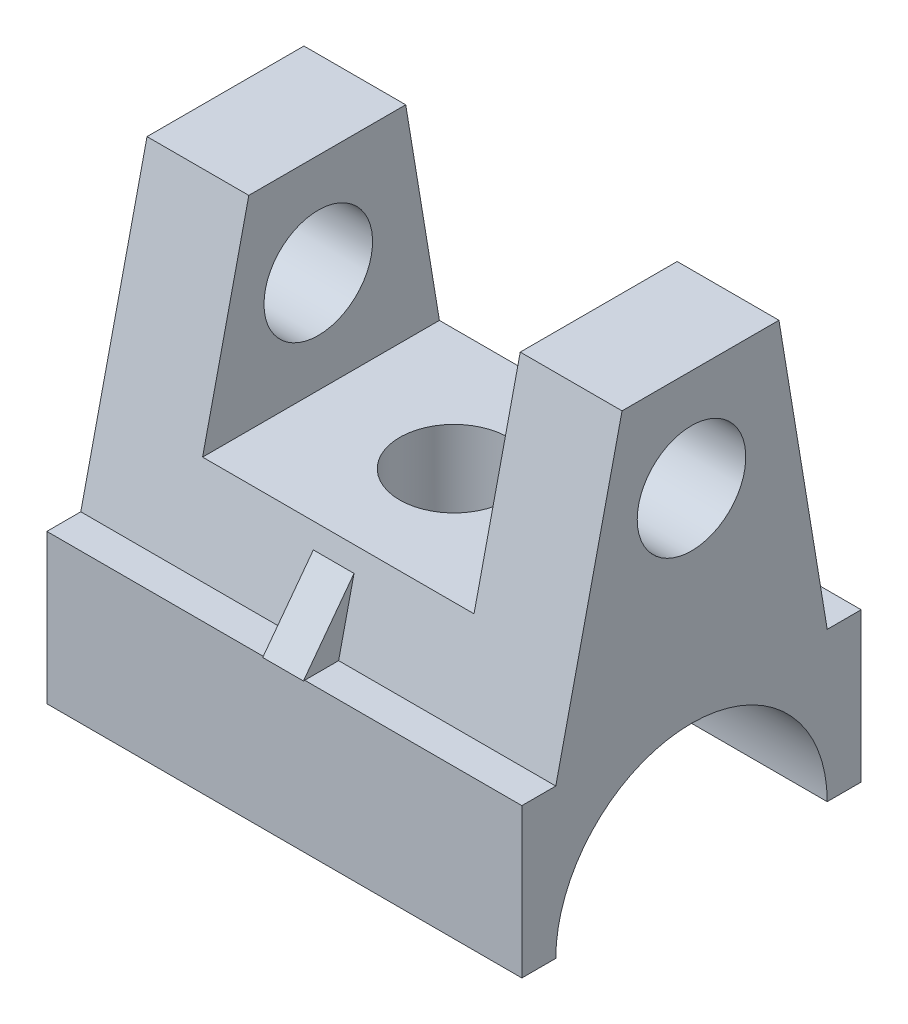
ISO-10303-21;
HEADER;
FILE_DESCRIPTION(('STEP AP214'),'2;1');
FILE_NAME('part.step','',(''),(''),'','','');
FILE_SCHEMA(('AUTOMOTIVE_DESIGN { 1 0 10303 214 1 1 1 1 }'));
ENDSEC;
DATA;
#1=APPLICATION_CONTEXT('core data for automotive mechanical design processes');
#2=APPLICATION_PROTOCOL_DEFINITION('international standard','automotive_design',2000,#1);
#3=PRODUCT_CONTEXT('',#1,'mechanical');
#4=PRODUCT('Part','Part','',(#3));
#5=PRODUCT_RELATED_PRODUCT_CATEGORY('part','',(#4));
#6=PRODUCT_DEFINITION_FORMATION('','',#4);
#7=PRODUCT_DEFINITION_CONTEXT('part definition',#1,'design');
#8=PRODUCT_DEFINITION('design','',#6,#7);
#9=PRODUCT_DEFINITION_SHAPE('','',#8);
#10=(LENGTH_UNIT() NAMED_UNIT(*) SI_UNIT(.MILLI.,.METRE.));
#11=(NAMED_UNIT(*) PLANE_ANGLE_UNIT() SI_UNIT($,.RADIAN.));
#12=(NAMED_UNIT(*) SI_UNIT($,.STERADIAN.) SOLID_ANGLE_UNIT());
#13=UNCERTAINTY_MEASURE_WITH_UNIT(LENGTH_MEASURE(1.E-05),#10,'distance_accuracy_value','');
#14=(GEOMETRIC_REPRESENTATION_CONTEXT(3) GLOBAL_UNCERTAINTY_ASSIGNED_CONTEXT((#13)) GLOBAL_UNIT_ASSIGNED_CONTEXT((#10,
#11,#12)) REPRESENTATION_CONTEXT('',''));
#15=CARTESIAN_POINT('',(0.,0.,0.));
#16=DIRECTION('',(0.,0.,1.));
#17=DIRECTION('',(1.,0.,0.));
#18=AXIS2_PLACEMENT_3D('',#15,#16,#17);
#19=CARTESIAN_POINT('',(0.,44.,0.));
#20=DIRECTION('',(0.,-1.,0.));
#21=DIRECTION('',(0.,0.,-1.));
#22=AXIS2_PLACEMENT_3D('',#19,#20,#21);
#23=PLANE('',#22);
#24=DIRECTION('',(0.,0.,-1.));
#25=VECTOR('',#24,1.);
#26=CARTESIAN_POINT('',(64.,44.,-90.));
#27=LINE('',#26,#25);
#28=CARTESIAN_POINT('',(64.,44.,-90.));
#29=VERTEX_POINT('',#28);
#30=CARTESIAN_POINT('',(64.,44.,-100.));
#31=VERTEX_POINT('',#30);
#32=EDGE_CURVE('E60',#29,#31,#27,.T.);
#33=ORIENTED_EDGE('',*,*,#32,.T.);
#34=DIRECTION('',(1.,0.,0.));
#35=VECTOR('',#34,1.);
#36=CARTESIAN_POINT('',(0.,44.,-100.));
#37=LINE('',#36,#35);
#38=CARTESIAN_POINT('',(0.,44.,-100.));
#39=VERTEX_POINT('',#38);
#40=EDGE_CURVE('E431',#39,#31,#37,.T.);
#41=ORIENTED_EDGE('',*,*,#40,.F.);
#42=DIRECTION('',(0.,0.,1.));
#43=VECTOR('',#42,1.);
#44=CARTESIAN_POINT('',(0.,44.,-100.));
#45=LINE('',#44,#43);
#46=CARTESIAN_POINT('',(0.,44.,-90.));
#47=VERTEX_POINT('',#46);
#48=EDGE_CURVE('E383',#39,#47,#45,.T.);
#49=ORIENTED_EDGE('',*,*,#48,.T.);
#50=DIRECTION('',(-1.,0.,0.));
#51=VECTOR('',#50,1.);
#52=CARTESIAN_POINT('',(140.,44.,-90.));
#53=LINE('',#52,#51);
#54=EDGE_CURVE('E478',#29,#47,#53,.T.);
#55=ORIENTED_EDGE('',*,*,#54,.F.);
#56=EDGE_LOOP('',(#33,#41,#49,#55));
#57=FACE_BOUND('',#56,.T.);
#58=ADVANCED_FACE('F36',(#57),#23,.F.);
#59=CARTESIAN_POINT('',(140.,44.,-90.));
#60=DIRECTION('',(0.,0.163185462498072,-0.986595410910313));
#61=DIRECTION('',(0.,0.986595410910314,0.163185462498072));
#62=AXIS2_PLACEMENT_3D('',#59,#60,#61);
#63=PLANE('',#62);
#64=DIRECTION('',(1.,0.,0.));
#65=VECTOR('',#64,1.);
#66=CARTESIAN_POINT('',(64.,64.,-86.6919476678388));
#67=LINE('',#66,#65);
#68=CARTESIAN_POINT('',(64.,64.0000000000001,-86.6919476678387));
#69=VERTEX_POINT('',#68);
#70=CARTESIAN_POINT('',(76.,64.,-86.6919476678387));
#71=VERTEX_POINT('',#70);
#72=EDGE_CURVE('E211',#69,#71,#67,.T.);
#73=ORIENTED_EDGE('',*,*,#72,.F.);
#74=DIRECTION('',(0.,-0.986595410910314,-0.16318546249807));
#75=VECTOR('',#74,1.);
#76=CARTESIAN_POINT('',(64.,64.,-86.6919476678388));
#77=LINE('',#76,#75);
#78=EDGE_CURVE('E199',#69,#29,#77,.T.);
#79=ORIENTED_EDGE('',*,*,#78,.T.);
#80=ORIENTED_EDGE('',*,*,#54,.T.);
#81=DIRECTION('',(0.,-0.986595410910313,-0.163185462498072));
#82=VECTOR('',#81,1.);
#83=CARTESIAN_POINT('',(0.,44.,-90.));
#84=LINE('',#83,#82);
#85=CARTESIAN_POINT('',(0.,130.,-75.7753749717067));
#86=VERTEX_POINT('',#85);
#87=EDGE_CURVE('E476',#86,#47,#84,.T.);
#88=ORIENTED_EDGE('',*,*,#87,.F.);
#89=DIRECTION('',(-1.,0.,0.));
#90=VECTOR('',#89,1.);
#91=CARTESIAN_POINT('',(140.,130.,-75.7753749717067));
#92=LINE('',#91,#90);
#93=CARTESIAN_POINT('',(30.,130.,-75.7753749717067));
#94=VERTEX_POINT('',#93);
#95=EDGE_CURVE('E412',#94,#86,#92,.T.);
#96=ORIENTED_EDGE('',*,*,#95,.F.);
#97=DIRECTION('',(0.,0.986595410910314,0.163185462498072));
#98=VECTOR('',#97,1.);
#99=CARTESIAN_POINT('',(30.,44.,-90.));
#100=LINE('',#99,#98);
#101=CARTESIAN_POINT('',(30.,70.,-85.6995319681904));
#102=VERTEX_POINT('',#101);
#103=EDGE_CURVE('E473',#102,#94,#100,.T.);
#104=ORIENTED_EDGE('',*,*,#103,.F.);
#105=DIRECTION('',(-1.,0.,0.));
#106=VECTOR('',#105,1.);
#107=CARTESIAN_POINT('',(140.,70.,-85.6995319681904));
#108=LINE('',#107,#106);
#109=CARTESIAN_POINT('',(110.,70.,-85.6995319681904));
#110=VERTEX_POINT('',#109);
#111=EDGE_CURVE('E486',#110,#102,#108,.T.);
#112=ORIENTED_EDGE('',*,*,#111,.F.);
#113=DIRECTION('',(0.,-0.986595410910314,-0.163185462498072));
#114=VECTOR('',#113,1.);
#115=CARTESIAN_POINT('',(110.,44.,-90.));
#116=LINE('',#115,#114);
#117=CARTESIAN_POINT('',(110.,130.,-75.7753749717067));
#118=VERTEX_POINT('',#117);
#119=EDGE_CURVE('E489',#118,#110,#116,.T.);
#120=ORIENTED_EDGE('',*,*,#119,.F.);
#121=CARTESIAN_POINT('',(140.,130.,-75.7753749717067));
#122=VERTEX_POINT('',#121);
#123=EDGE_CURVE('E408',#122,#118,#92,.T.);
#124=ORIENTED_EDGE('',*,*,#123,.F.);
#125=DIRECTION('',(0.,-0.986595410910313,-0.163185462498072));
#126=VECTOR('',#125,1.);
#127=CARTESIAN_POINT('',(140.,44.,-90.));
#128=LINE('',#127,#126);
#129=CARTESIAN_POINT('',(140.,44.,-90.));
#130=VERTEX_POINT('',#129);
#131=EDGE_CURVE('E463',#122,#130,#128,.T.);
#132=ORIENTED_EDGE('',*,*,#131,.T.);
#133=CARTESIAN_POINT('',(76.,44.,-90.));
#134=VERTEX_POINT('',#133);
#135=EDGE_CURVE('E422',#130,#134,#53,.T.);
#136=ORIENTED_EDGE('',*,*,#135,.T.);
#137=DIRECTION('',(0.,-0.986595410910314,-0.16318546249807));
#138=VECTOR('',#137,1.);
#139=CARTESIAN_POINT('',(76.,64.,-86.6919476678388));
#140=LINE('',#139,#138);
#141=EDGE_CURVE('E503',#71,#134,#140,.T.);
#142=ORIENTED_EDGE('',*,*,#141,.F.);
#143=EDGE_LOOP('',(#73,#79,#80,#88,#96,#104,#112,#120,#124,#132,#136,#142));
#144=FACE_BOUND('',#143,.T.);
#145=ADVANCED_FACE('F291',(#144),#63,.T.);
#146=DIRECTION('',(0.,0.,-1.));
#147=VECTOR('',#146,1.);
#148=CARTESIAN_POINT('',(64.,44.,0.380318398329267));
#149=LINE('',#148,#147);
#150=CARTESIAN_POINT('',(64.,44.,0.));
#151=VERTEX_POINT('',#150);
#152=CARTESIAN_POINT('',(64.,44.,-10.));
#153=VERTEX_POINT('',#152);
#154=EDGE_CURVE('E221',#151,#153,#149,.T.);
#155=ORIENTED_EDGE('',*,*,#154,.T.);
#156=DIRECTION('',(-1.,0.,0.));
#157=VECTOR('',#156,1.);
#158=CARTESIAN_POINT('',(140.,44.,-10.));
#159=LINE('',#158,#157);
#160=CARTESIAN_POINT('',(0.,44.,-10.));
#161=VERTEX_POINT('',#160);
#162=EDGE_CURVE('E420',#153,#161,#159,.T.);
#163=ORIENTED_EDGE('',*,*,#162,.T.);
#164=CARTESIAN_POINT('',(0.,44.,0.));
#165=VERTEX_POINT('',#164);
#166=EDGE_CURVE('E432',#161,#165,#45,.T.);
#167=ORIENTED_EDGE('',*,*,#166,.T.);
#168=DIRECTION('',(1.,0.,0.));
#169=VECTOR('',#168,1.);
#170=CARTESIAN_POINT('',(0.,44.,0.));
#171=LINE('',#170,#169);
#172=EDGE_CURVE('E424',#165,#151,#171,.T.);
#173=ORIENTED_EDGE('',*,*,#172,.T.);
#174=EDGE_LOOP('',(#155,#163,#167,#173));
#175=FACE_BOUND('',#174,.T.);
#176=ADVANCED_FACE('F294',(#175),#23,.F.);
#177=CARTESIAN_POINT('',(140.,130.,-29.5244844802235));
#178=DIRECTION('',(0.,0.221394989815989,0.975184217717031));
#179=DIRECTION('',(0.,-0.975184217717031,0.221394989815989));
#180=AXIS2_PLACEMENT_3D('',#177,#178,#179);
#181=PLANE('',#180);
#182=ORIENTED_EDGE('',*,*,#162,.F.);
#183=DIRECTION('',(0.,-0.975184217717031,0.22139498981599));
#184=VECTOR('',#183,1.);
#185=CARTESIAN_POINT('',(64.,64.,-14.5405777860985));
#186=LINE('',#185,#184);
#187=CARTESIAN_POINT('',(64.,64.,-14.5405777860985));
#188=VERTEX_POINT('',#187);
#189=EDGE_CURVE('E226',#188,#153,#186,.T.);
#190=ORIENTED_EDGE('',*,*,#189,.F.);
#191=DIRECTION('',(1.,0.,0.));
#192=VECTOR('',#191,1.);
#193=CARTESIAN_POINT('',(64.,64.,-14.5405777860985));
#194=LINE('',#193,#192);
#195=CARTESIAN_POINT('',(76.,64.,-14.5405777860985));
#196=VERTEX_POINT('',#195);
#197=EDGE_CURVE('E237',#188,#196,#194,.T.);
#198=ORIENTED_EDGE('',*,*,#197,.T.);
#199=DIRECTION('',(0.,-0.975184217717031,0.22139498981599));
#200=VECTOR('',#199,1.);
#201=CARTESIAN_POINT('',(76.,64.,-14.5405777860985));
#202=LINE('',#201,#200);
#203=CARTESIAN_POINT('',(76.,44.,-10.));
#204=VERTEX_POINT('',#203);
#205=EDGE_CURVE('E222',#196,#204,#202,.T.);
#206=ORIENTED_EDGE('',*,*,#205,.T.);
#207=CARTESIAN_POINT('',(140.,44.,-10.));
#208=VERTEX_POINT('',#207);
#209=EDGE_CURVE('E416',#208,#204,#159,.T.);
#210=ORIENTED_EDGE('',*,*,#209,.F.);
#211=DIRECTION('',(0.,0.975184217717031,-0.221394989815989));
#212=VECTOR('',#211,1.);
#213=CARTESIAN_POINT('',(140.,130.,-29.5244844802235));
#214=LINE('',#213,#212);
#215=CARTESIAN_POINT('',(140.,130.,-29.5244844802235));
#216=VERTEX_POINT('',#215);
#217=EDGE_CURVE('E411',#208,#216,#214,.T.);
#218=ORIENTED_EDGE('',*,*,#217,.T.);
#219=DIRECTION('',(-1.,0.,0.));
#220=VECTOR('',#219,1.);
#221=CARTESIAN_POINT('',(140.,130.,-29.5244844802235));
#222=LINE('',#221,#220);
#223=CARTESIAN_POINT('',(110.,130.,-29.5244844802235));
#224=VERTEX_POINT('',#223);
#225=EDGE_CURVE('E406',#216,#224,#222,.T.);
#226=ORIENTED_EDGE('',*,*,#225,.T.);
#227=DIRECTION('',(0.,0.975184217717031,-0.221394989815989));
#228=VECTOR('',#227,1.);
#229=CARTESIAN_POINT('',(110.,130.,-29.5244844802235));
#230=LINE('',#229,#228);
#231=CARTESIAN_POINT('',(110.,70.,-15.902751121928));
#232=VERTEX_POINT('',#231);
#233=EDGE_CURVE('E45',#232,#224,#230,.T.);
#234=ORIENTED_EDGE('',*,*,#233,.F.);
#235=DIRECTION('',(1.,0.,0.));
#236=VECTOR('',#235,1.);
#237=CARTESIAN_POINT('',(140.,70.,-15.9027511219281));
#238=LINE('',#237,#236);
#239=CARTESIAN_POINT('',(30.,70.,-15.902751121928));
#240=VERTEX_POINT('',#239);
#241=EDGE_CURVE('E392',#240,#232,#238,.T.);
#242=ORIENTED_EDGE('',*,*,#241,.F.);
#243=DIRECTION('',(0.,-0.975184217717031,0.221394989815989));
#244=VECTOR('',#243,1.);
#245=CARTESIAN_POINT('',(30.,130.,-29.5244844802235));
#246=LINE('',#245,#244);
#247=CARTESIAN_POINT('',(30.,130.,-29.5244844802235));
#248=VERTEX_POINT('',#247);
#249=EDGE_CURVE('E11',#248,#240,#246,.T.);
#250=ORIENTED_EDGE('',*,*,#249,.F.);
#251=CARTESIAN_POINT('',(0.,130.,-29.5244844802235));
#252=VERTEX_POINT('',#251);
#253=EDGE_CURVE('E413',#248,#252,#222,.T.);
#254=ORIENTED_EDGE('',*,*,#253,.T.);
#255=DIRECTION('',(0.,0.975184217717031,-0.221394989815989));
#256=VECTOR('',#255,1.);
#257=CARTESIAN_POINT('',(0.,130.,-29.5244844802235));
#258=LINE('',#257,#256);
#259=EDGE_CURVE('E462',#161,#252,#258,.T.);
#260=ORIENTED_EDGE('',*,*,#259,.F.);
#261=EDGE_LOOP('',(#182,#190,#198,#206,#210,#218,#226,#234,#242,#250,#254,#260));
#262=FACE_BOUND('',#261,.T.);
#263=ADVANCED_FACE('F299',(#262),#181,.T.);
#264=CARTESIAN_POINT('',(140.,130.,-75.7753749717067));
#265=DIRECTION('',(0.,1.,0.));
#266=DIRECTION('',(0.,0.,1.));
#267=AXIS2_PLACEMENT_3D('',#264,#265,#266);
#268=PLANE('',#267);
#269=DIRECTION('',(0.,0.,1.));
#270=VECTOR('',#269,1.);
#271=CARTESIAN_POINT('',(30.,130.,-100.));
#272=LINE('',#271,#270);
#273=EDGE_CURVE('E263',#94,#248,#272,.T.);
#274=ORIENTED_EDGE('',*,*,#273,.F.);
#275=ORIENTED_EDGE('',*,*,#95,.T.);
#276=DIRECTION('',(0.,0.,-1.));
#277=VECTOR('',#276,1.);
#278=CARTESIAN_POINT('',(0.,130.,-75.7753749717067));
#279=LINE('',#278,#277);
#280=EDGE_CURVE('E472',#252,#86,#279,.T.);
#281=ORIENTED_EDGE('',*,*,#280,.F.);
#282=ORIENTED_EDGE('',*,*,#253,.F.);
#283=EDGE_LOOP('',(#274,#275,#281,#282));
#284=FACE_BOUND('',#283,.T.);
#285=ADVANCED_FACE('F298',(#284),#268,.T.);
#286=CARTESIAN_POINT('',(76.,44.,-100.));
#287=VERTEX_POINT('',#286);
#288=CARTESIAN_POINT('',(140.,44.,-100.));
#289=VERTEX_POINT('',#288);
#290=EDGE_CURVE('E52',#287,#289,#37,.T.);
#291=ORIENTED_EDGE('',*,*,#290,.F.);
#292=DIRECTION('',(0.,0.,-1.));
#293=VECTOR('',#292,1.);
#294=CARTESIAN_POINT('',(76.,44.,-90.));
#295=LINE('',#294,#293);
#296=EDGE_CURVE('E498',#134,#287,#295,.T.);
#297=ORIENTED_EDGE('',*,*,#296,.F.);
#298=ORIENTED_EDGE('',*,*,#135,.F.);
#299=DIRECTION('',(0.,0.,1.));
#300=VECTOR('',#299,1.);
#301=CARTESIAN_POINT('',(140.,44.,-100.));
#302=LINE('',#301,#300);
#303=EDGE_CURVE('E428',#289,#130,#302,.T.);
#304=ORIENTED_EDGE('',*,*,#303,.F.);
#305=EDGE_LOOP('',(#291,#297,#298,#304));
#306=FACE_BOUND('',#305,.T.);
#307=ADVANCED_FACE('F306',(#306),#23,.F.);
#308=CARTESIAN_POINT('',(0.,0.,0.));
#309=DIRECTION('',(0.,-1.,0.));
#310=DIRECTION('',(0.,0.,-1.));
#311=AXIS2_PLACEMENT_3D('',#308,#309,#310);
#312=PLANE('',#311);
#313=DIRECTION('',(0.,0.,1.));
#314=VECTOR('',#313,1.);
#315=CARTESIAN_POINT('',(0.,0.,-100.));
#316=LINE('',#315,#314);
#317=CARTESIAN_POINT('',(0.,0.,-10.));
#318=VERTEX_POINT('',#317);
#319=CARTESIAN_POINT('',(0.,0.,0.));
#320=VERTEX_POINT('',#319);
#321=EDGE_CURVE('E371',#318,#320,#316,.T.);
#322=ORIENTED_EDGE('',*,*,#321,.F.);
#323=DIRECTION('',(1.,0.,0.));
#324=VECTOR('',#323,1.);
#325=CARTESIAN_POINT('',(-396.979728804231,0.,-9.99999999999996));
#326=LINE('',#325,#324);
#327=CARTESIAN_POINT('',(140.,0.,-10.));
#328=VERTEX_POINT('',#327);
#329=EDGE_CURVE('E362',#318,#328,#326,.T.);
#330=ORIENTED_EDGE('',*,*,#329,.T.);
#331=DIRECTION('',(0.,0.,1.));
#332=VECTOR('',#331,1.);
#333=CARTESIAN_POINT('',(140.,0.,-100.));
#334=LINE('',#333,#332);
#335=CARTESIAN_POINT('',(140.,0.,0.));
#336=VERTEX_POINT('',#335);
#337=EDGE_CURVE('E358',#328,#336,#334,.T.);
#338=ORIENTED_EDGE('',*,*,#337,.T.);
#339=DIRECTION('',(1.,0.,0.));
#340=VECTOR('',#339,1.);
#341=CARTESIAN_POINT('',(0.,0.,0.));
#342=LINE('',#341,#340);
#343=EDGE_CURVE('E361',#320,#336,#342,.T.);
#344=ORIENTED_EDGE('',*,*,#343,.F.);
#345=EDGE_LOOP('',(#322,#330,#338,#344));
#346=FACE_BOUND('',#345,.T.);
#347=ADVANCED_FACE('F324',(#346),#312,.T.);
#348=CARTESIAN_POINT('',(0.,44.,0.));
#349=DIRECTION('',(0.,0.,-1.));
#350=DIRECTION('',(-1.,0.,0.));
#351=AXIS2_PLACEMENT_3D('',#348,#349,#350);
#352=PLANE('',#351);
#353=ORIENTED_EDGE('',*,*,#343,.T.);
#354=DIRECTION('',(0.,-1.,0.));
#355=VECTOR('',#354,1.);
#356=CARTESIAN_POINT('',(140.,44.,0.));
#357=LINE('',#356,#355);
#358=CARTESIAN_POINT('',(140.,44.,0.));
#359=VERTEX_POINT('',#358);
#360=EDGE_CURVE('E387',#359,#336,#357,.T.);
#361=ORIENTED_EDGE('',*,*,#360,.F.);
#362=CARTESIAN_POINT('',(76.,44.,0.));
#363=VERTEX_POINT('',#362);
#364=EDGE_CURVE('E378',#363,#359,#171,.T.);
#365=ORIENTED_EDGE('',*,*,#364,.F.);
#366=DIRECTION('',(-1.,0.,0.));
#367=VECTOR('',#366,1.);
#368=CARTESIAN_POINT('',(0.,44.,0.));
#369=LINE('',#368,#367);
#370=EDGE_CURVE('E239',#363,#151,#369,.T.);
#371=ORIENTED_EDGE('',*,*,#370,.T.);
#372=ORIENTED_EDGE('',*,*,#172,.F.);
#373=DIRECTION('',(0.,-1.,0.));
#374=VECTOR('',#373,1.);
#375=CARTESIAN_POINT('',(0.,44.,0.));
#376=LINE('',#375,#374);
#377=EDGE_CURVE('E379',#165,#320,#376,.T.);
#378=ORIENTED_EDGE('',*,*,#377,.T.);
#379=EDGE_LOOP('',(#353,#361,#365,#371,#372,#378));
#380=FACE_BOUND('',#379,.T.);
#381=ADVANCED_FACE('F38',(#380),#352,.F.);
#382=CARTESIAN_POINT('',(140.,44.,-100.));
#383=DIRECTION('',(1.,0.,0.));
#384=DIRECTION('',(0.,0.,-1.));
#385=AXIS2_PLACEMENT_3D('',#382,#383,#384);
#386=PLANE('',#385);
#387=CARTESIAN_POINT('',(140.,100.,-50.));
#388=DIRECTION('',(-1.,0.,0.));
#389=DIRECTION('',(0.,0.,1.));
#390=AXIS2_PLACEMENT_3D('',#387,#388,#389);
#391=CIRCLE('',#390,16.);
#392=CARTESIAN_POINT('',(140.,100.,-34.));
#393=VERTEX_POINT('',#392);
#394=EDGE_CURVE('E243',#393,#393,#391,.T.);
#395=ORIENTED_EDGE('',*,*,#394,.T.);
#396=EDGE_LOOP('',(#395));
#397=FACE_BOUND('',#396,.T.);
#398=CARTESIAN_POINT('',(140.,0.,-50.));
#399=DIRECTION('',(1.,0.,0.));
#400=DIRECTION('',(0.,0.,-1.));
#401=AXIS2_PLACEMENT_3D('',#398,#399,#400);
#402=CIRCLE('',#401,40.);
#403=CARTESIAN_POINT('',(140.,0.,-90.));
#404=VERTEX_POINT('',#403);
#405=EDGE_CURVE('E352',#404,#328,#402,.T.);
#406=ORIENTED_EDGE('',*,*,#405,.F.);
#407=CARTESIAN_POINT('',(140.,0.,-100.));
#408=VERTEX_POINT('',#407);
#409=EDGE_CURVE('E355',#408,#404,#334,.T.);
#410=ORIENTED_EDGE('',*,*,#409,.F.);
#411=DIRECTION('',(0.,-1.,0.));
#412=VECTOR('',#411,1.);
#413=CARTESIAN_POINT('',(140.,44.,-100.));
#414=LINE('',#413,#412);
#415=EDGE_CURVE('E385',#289,#408,#414,.T.);
#416=ORIENTED_EDGE('',*,*,#415,.F.);
#417=ORIENTED_EDGE('',*,*,#303,.T.);
#418=ORIENTED_EDGE('',*,*,#131,.F.);
#419=DIRECTION('',(0.,0.,-1.));
#420=VECTOR('',#419,1.);
#421=CARTESIAN_POINT('',(140.,130.,-75.7753749717067));
#422=LINE('',#421,#420);
#423=EDGE_CURVE('E464',#216,#122,#422,.T.);
#424=ORIENTED_EDGE('',*,*,#423,.F.);
#425=ORIENTED_EDGE('',*,*,#217,.F.);
#426=EDGE_CURVE('E427',#208,#359,#302,.T.);
#427=ORIENTED_EDGE('',*,*,#426,.T.);
#428=ORIENTED_EDGE('',*,*,#360,.T.);
#429=ORIENTED_EDGE('',*,*,#337,.F.);
#430=EDGE_LOOP('',(#406,#410,#416,#417,#418,#424,#425,#427,#428,#429));
#431=FACE_BOUND('',#430,.T.);
#432=ADVANCED_FACE('F337',(#397,#431),#386,.T.);
#433=CARTESIAN_POINT('',(0.,44.,-100.));
#434=DIRECTION('',(0.,0.,-1.));
#435=DIRECTION('',(-1.,0.,0.));
#436=AXIS2_PLACEMENT_3D('',#433,#434,#435);
#437=PLANE('',#436);
#438=DIRECTION('',(1.,0.,0.));
#439=VECTOR('',#438,1.);
#440=CARTESIAN_POINT('',(0.,0.,-100.));
#441=LINE('',#440,#439);
#442=CARTESIAN_POINT('',(0.,0.,-100.));
#443=VERTEX_POINT('',#442);
#444=EDGE_CURVE('E369',#443,#408,#441,.T.);
#445=ORIENTED_EDGE('',*,*,#444,.F.);
#446=DIRECTION('',(0.,-1.,0.));
#447=VECTOR('',#446,1.);
#448=CARTESIAN_POINT('',(0.,44.,-100.));
#449=LINE('',#448,#447);
#450=EDGE_CURVE('E382',#39,#443,#449,.T.);
#451=ORIENTED_EDGE('',*,*,#450,.F.);
#452=ORIENTED_EDGE('',*,*,#40,.T.);
#453=DIRECTION('',(-1.,0.,0.));
#454=VECTOR('',#453,1.);
#455=CARTESIAN_POINT('',(0.,44.,-100.));
#456=LINE('',#455,#454);
#457=EDGE_CURVE('E197',#287,#31,#456,.T.);
#458=ORIENTED_EDGE('',*,*,#457,.F.);
#459=ORIENTED_EDGE('',*,*,#290,.T.);
#460=ORIENTED_EDGE('',*,*,#415,.T.);
#461=EDGE_LOOP('',(#445,#451,#452,#458,#459,#460));
#462=FACE_BOUND('',#461,.T.);
#463=ADVANCED_FACE('F325',(#462),#437,.T.);
#464=CARTESIAN_POINT('',(0.,44.,-100.));
#465=DIRECTION('',(1.,0.,0.));
#466=DIRECTION('',(0.,0.,-1.));
#467=AXIS2_PLACEMENT_3D('',#464,#465,#466);
#468=PLANE('',#467);
#469=CARTESIAN_POINT('',(0.,100.,-50.));
#470=DIRECTION('',(-1.,0.,0.));
#471=DIRECTION('',(0.,0.,1.));
#472=AXIS2_PLACEMENT_3D('',#469,#470,#471);
#473=CIRCLE('',#472,16.);
#474=CARTESIAN_POINT('',(0.,100.,-34.));
#475=VERTEX_POINT('',#474);
#476=EDGE_CURVE('E242',#475,#475,#473,.T.);
#477=ORIENTED_EDGE('',*,*,#476,.F.);
#478=EDGE_LOOP('',(#477));
#479=FACE_BOUND('',#478,.T.);
#480=CARTESIAN_POINT('',(0.,0.,-90.));
#481=VERTEX_POINT('',#480);
#482=EDGE_CURVE('E376',#443,#481,#316,.T.);
#483=ORIENTED_EDGE('',*,*,#482,.T.);
#484=CARTESIAN_POINT('',(0.,0.,-50.));
#485=DIRECTION('',(1.,0.,0.));
#486=DIRECTION('',(0.,0.,-1.));
#487=AXIS2_PLACEMENT_3D('',#484,#485,#486);
#488=CIRCLE('',#487,40.);
#489=EDGE_CURVE('E389',#481,#318,#488,.T.);
#490=ORIENTED_EDGE('',*,*,#489,.T.);
#491=ORIENTED_EDGE('',*,*,#321,.T.);
#492=ORIENTED_EDGE('',*,*,#377,.F.);
#493=ORIENTED_EDGE('',*,*,#166,.F.);
#494=ORIENTED_EDGE('',*,*,#259,.T.);
#495=ORIENTED_EDGE('',*,*,#280,.T.);
#496=ORIENTED_EDGE('',*,*,#87,.T.);
#497=ORIENTED_EDGE('',*,*,#48,.F.);
#498=ORIENTED_EDGE('',*,*,#450,.T.);
#499=EDGE_LOOP('',(#483,#490,#491,#492,#493,#494,#495,#496,#497,#498));
#500=FACE_BOUND('',#499,.T.);
#501=ADVANCED_FACE('F317',(#479,#500),#468,.F.);
#502=ORIENTED_EDGE('',*,*,#209,.T.);
#503=DIRECTION('',(0.,0.,-1.));
#504=VECTOR('',#503,1.);
#505=CARTESIAN_POINT('',(76.,44.,0.380318398329266));
#506=LINE('',#505,#504);
#507=EDGE_CURVE('E232',#363,#204,#506,.T.);
#508=ORIENTED_EDGE('',*,*,#507,.F.);
#509=ORIENTED_EDGE('',*,*,#364,.T.);
#510=ORIENTED_EDGE('',*,*,#426,.F.);
#511=EDGE_LOOP('',(#502,#508,#509,#510));
#512=FACE_BOUND('',#511,.T.);
#513=ADVANCED_FACE('F311',(#512),#23,.F.);
#514=DIRECTION('',(1.,0.,0.));
#515=VECTOR('',#514,1.);
#516=CARTESIAN_POINT('',(-396.979728804231,0.,-89.9999999999999));
#517=LINE('',#516,#515);
#518=EDGE_CURVE('E366',#481,#404,#517,.T.);
#519=ORIENTED_EDGE('',*,*,#518,.F.);
#520=ORIENTED_EDGE('',*,*,#482,.F.);
#521=ORIENTED_EDGE('',*,*,#444,.T.);
#522=ORIENTED_EDGE('',*,*,#409,.T.);
#523=EDGE_LOOP('',(#519,#520,#521,#522));
#524=FACE_BOUND('',#523,.T.);
#525=ADVANCED_FACE('F316',(#524),#312,.T.);
#526=CARTESIAN_POINT('',(-396.979728804231,0.,-50.));
#527=DIRECTION('',(1.,0.,0.));
#528=DIRECTION('',(0.,0.,-1.));
#529=AXIS2_PLACEMENT_3D('',#526,#527,#528);
#530=CYLINDRICAL_SURFACE('',#529,40.);
#531=CARTESIAN_POINT('',(70.,36.6606055596467,-34.));
#532=CARTESIAN_POINT('',(70.4287092792773,36.6606088651928,-34.0000033061152));
#533=CARTESIAN_POINT('',(70.8575495325857,36.6681507991271,-34.0172539332521));
#534=CARTESIAN_POINT('',(71.7121302844531,36.6980761326191,-34.0860887840128));
#535=CARTESIAN_POINT('',(72.1378687244525,36.7204686159714,-34.1376940217626));
#536=CARTESIAN_POINT('',(72.9838554964065,36.7794093305369,-34.2748410302555));
#537=CARTESIAN_POINT('',(73.4040891003473,36.8159897155494,-34.360459896277));
#538=CARTESIAN_POINT('',(74.2350068041248,36.9020934543984,-34.5647237123335));
#539=CARTESIAN_POINT('',(74.645692277186,36.9516149343323,-34.6833638809639));
#540=CARTESIAN_POINT('',(75.4533534494024,37.0618346716715,-34.9520304420909));
#541=CARTESIAN_POINT('',(75.850374966115,37.1224901227956,-35.1019369173657));
#542=CARTESIAN_POINT('',(76.6299512726406,37.2533025992256,-35.4321258503748));
#543=CARTESIAN_POINT('',(77.0125055735925,37.3234599452432,-35.6124093334561));
#544=CARTESIAN_POINT('',(77.7608358488015,37.4712699277921,-36.0018832902801));
#545=CARTESIAN_POINT('',(78.126619746827,37.5489189696289,-36.2110599209943));
#546=CARTESIAN_POINT('',(78.8398334517016,37.7097053475151,-36.6570498777003));
#547=CARTESIAN_POINT('',(79.1872565302283,37.7928446707144,-36.8938732342111));
#548=CARTESIAN_POINT('',(79.879331247414,37.9668707662242,-37.4065995153301));
#549=CARTESIAN_POINT('',(80.2229108400693,38.0579358563393,-37.683889903199));
#550=CARTESIAN_POINT('',(80.8858176241132,38.2413329302928,-38.265713371874));
#551=CARTESIAN_POINT('',(81.2051439485139,38.3336649592817,-38.5702474257198));
#552=CARTESIAN_POINT('',(81.8178834336968,38.5172282678629,-39.2049868792206));
#553=CARTESIAN_POINT('',(82.1112831751554,38.6084589565657,-39.5352054085585));
#554=CARTESIAN_POINT('',(82.6701006421734,38.7873870812281,-40.2192267772192));
#555=CARTESIAN_POINT('',(82.9355280114624,38.8750857284061,-40.5730214193442));
#556=CARTESIAN_POINT('',(83.4467167120957,39.0480991869753,-41.3168303084859));
#557=CARTESIAN_POINT('',(83.6912782021047,39.1331809642443,-41.7077250135464));
#558=CARTESIAN_POINT('',(84.1464167695622,39.2947302748984,-42.5105533229553));
#559=CARTESIAN_POINT('',(84.3569926923899,39.3711975155879,-42.922487641475));
#560=CARTESIAN_POINT('',(84.7422060760614,39.5132963289844,-43.7644874918202));
#561=CARTESIAN_POINT('',(84.9168549273612,39.5789313346758,-44.1945472248324));
#562=CARTESIAN_POINT('',(85.2285502731176,39.6974551540186,-45.0697858045588));
#563=CARTESIAN_POINT('',(85.3655991700161,39.7503447820073,-45.5149636832585));
#564=CARTESIAN_POINT('',(85.5949202009969,39.8395649507823,-46.3951198848409));
#565=CARTESIAN_POINT('',(85.6890386564187,39.8765731164438,-46.8295488315141));
#566=CARTESIAN_POINT('',(85.8408881822982,39.936560429708,-47.7056809494668));
#567=CARTESIAN_POINT('',(85.898620326348,39.9595399912294,-48.1473839057292));
#568=CARTESIAN_POINT('',(85.977042856826,39.9908064958846,-49.0344435204382));
#569=CARTESIAN_POINT('',(85.9977450199408,39.9990981102346,-49.4797989719956));
#570=CARTESIAN_POINT('',(86.001905771455,40.0007622069673,-50.3707044392431));
#571=CARTESIAN_POINT('',(85.9853656691954,39.9941352138493,-50.8162544475425));
#572=CARTESIAN_POINT('',(85.9172129361726,39.9669460381279,-51.6789613300682));
#573=CARTESIAN_POINT('',(85.8676255879777,39.9471887254243,-52.0963055000354));
#574=CARTESIAN_POINT('',(85.7359553654849,39.8950703175298,-52.9250161306561));
#575=CARTESIAN_POINT('',(85.6538739415619,39.8627097848853,-53.3363828572637));
#576=CARTESIAN_POINT('',(85.4579957159159,39.7861975123436,-54.1503765503889));
#577=CARTESIAN_POINT('',(85.3441977735004,39.7420453483598,-54.5530032020059));
#578=CARTESIAN_POINT('',(85.08590744958,39.643037027919,-55.3469309448984));
#579=CARTESIAN_POINT('',(84.9414142006744,39.5881805689793,-55.7382317157673));
#580=CARTESIAN_POINT('',(84.6205402621696,39.4681863278346,-56.5129269062007));
#581=CARTESIAN_POINT('',(84.4437131441089,39.402906471712,-56.8961142399135));
#582=CARTESIAN_POINT('',(84.0610547353582,39.2642518083649,-57.6461760933813));
#583=CARTESIAN_POINT('',(83.8552233603457,39.1908769776066,-58.0130505657067));
#584=CARTESIAN_POINT('',(83.4159843877625,39.0377544310517,-58.7285511488685));
#585=CARTESIAN_POINT('',(83.1825736303173,38.9580059853454,-59.0771751620645));
#586=CARTESIAN_POINT('',(82.6896017621099,38.7939680059183,-59.7544615298707));
#587=CARTESIAN_POINT('',(82.4300312812203,38.709676850114,-60.0831166637985));
#588=CARTESIAN_POINT('',(81.8684829566876,38.5329118512933,-60.7395381933745));
#589=CARTESIAN_POINT('',(81.5648408991528,38.4402637248158,-61.065835558737));
#590=CARTESIAN_POINT('',(80.9314765412663,38.2544838031821,-61.6919257903463));
#591=CARTESIAN_POINT('',(80.6017528415209,38.1613519823245,-61.9917172326051));
#592=CARTESIAN_POINT('',(79.9179425217659,37.9770607800323,-62.5631621653668));
#593=CARTESIAN_POINT('',(79.5638437063771,37.8859024163833,-62.8348013979273));
#594=CARTESIAN_POINT('',(78.8335501028436,37.7081720798797,-63.3479391205073));
#595=CARTESIAN_POINT('',(78.4573635126627,37.6215984277999,-63.5894486905667));
#596=CARTESIAN_POINT('',(77.6738738572178,37.4531423710006,-64.0471817609164));
#597=CARTESIAN_POINT('',(77.2659891270431,37.3714643880158,-64.2624868124322));
#598=CARTESIAN_POINT('',(76.4315546006074,37.2182313090193,-64.6577015657319));
#599=CARTESIAN_POINT('',(76.0050042943461,37.1466764898295,-64.8376102996418));
#600=CARTESIAN_POINT('',(75.1364194904155,37.0161937610264,-65.1602008892743));
#601=CARTESIAN_POINT('',(74.6943933717512,36.9572591378559,-65.3029025468559));
#602=CARTESIAN_POINT('',(73.7980012437275,36.8541272894201,-65.5496376030718));
#603=CARTESIAN_POINT('',(73.3436362309073,36.809928877804,-65.6536741145528));
#604=CARTESIAN_POINT('',(72.4543386349076,36.7401611044256,-65.8166976089678));
#605=CARTESIAN_POINT('',(72.019914877542,36.7136185436633,-65.8780486448517));
#606=CARTESIAN_POINT('',(71.146833129702,36.6759467429269,-65.9648737565388));
#607=CARTESIAN_POINT('',(70.70817531367,36.6648168706588,-65.9903493041076));
#608=CARTESIAN_POINT('',(69.8302533230617,36.6583711764338,-66.0051206035495));
#609=CARTESIAN_POINT('',(69.3909893396875,36.6630511699543,-65.9944259288815));
#610=CARTESIAN_POINT('',(68.5152808165676,36.6880476950031,-65.9370052219771));
#611=CARTESIAN_POINT('',(68.0788362060217,36.7083638323249,-65.890280098113));
#612=CARTESIAN_POINT('',(67.2369508522368,36.7623191100113,-65.7650317744916));
#613=CARTESIAN_POINT('',(66.8311621435983,36.7951317939505,-65.6884753393265));
#614=CARTESIAN_POINT('',(66.0278495243732,36.8730004910764,-65.5045733356965));
#615=CARTESIAN_POINT('',(65.6303252331074,36.9180559389804,-65.3972291887733));
#616=CARTESIAN_POINT('',(64.8459353504619,37.0190904250513,-65.1527035040602));
#617=CARTESIAN_POINT('',(64.4590714717363,37.0750712068914,-65.0155172030886));
#618=CARTESIAN_POINT('',(63.6982720631143,37.1963803216116,-64.7124408137365));
#619=CARTESIAN_POINT('',(63.3243371060761,37.2617090680265,-64.5465494554349));
#620=CARTESIAN_POINT('',(62.5765894726767,37.4027648079061,-64.1800305689631));
#621=CARTESIAN_POINT('',(62.2033906599844,37.4788050273532,-63.9782714448474));
#622=CARTESIAN_POINT('',(61.4750180109289,37.6370677525513,-63.5463658192195));
#623=CARTESIAN_POINT('',(61.1198504070577,37.7192923718986,-63.3162095952733));
#624=CARTESIAN_POINT('',(60.4294164425465,37.8877810655652,-62.8289705765686));
#625=CARTESIAN_POINT('',(60.0941536276204,37.9740458547084,-62.5718830068431));
#626=CARTESIAN_POINT('',(59.4452690418958,38.1484555801403,-62.0322787408152));
#627=CARTESIAN_POINT('',(59.1316483137176,38.2366006067432,-61.7497608208995));
#628=CARTESIAN_POINT('',(58.5052557113844,38.4191728270864,-61.1389463011953));
#629=CARTESIAN_POINT('',(58.1942705425696,38.5135812876664,-60.8088086073855));
#630=CARTESIAN_POINT('',(57.6011761696831,38.6995030949045,-60.1229758401447));
#631=CARTESIAN_POINT('',(57.3190578354014,38.7910173505958,-59.767288908568));
#632=CARTESIAN_POINT('',(56.7854261549143,38.9687264079357,-59.0322390271174));
#633=CARTESIAN_POINT('',(56.5339206962894,39.0549198358356,-58.6528700133522));
#634=CARTESIAN_POINT('',(56.0635064960636,39.219603455458,-57.8728373398084));
#635=CARTESIAN_POINT('',(55.8445970125858,39.2980938224866,-57.4721741649617));
#636=CARTESIAN_POINT('',(55.4412474272982,39.4451771886561,-56.652176102562));
#637=CARTESIAN_POINT('',(55.2568017650765,39.5137717839786,-56.2328442405672));
#638=CARTESIAN_POINT('',(54.9240678050723,39.6391216539284,-55.3783340117604));
#639=CARTESIAN_POINT('',(54.7757798193547,39.6958768263729,-54.9431555082185));
#640=CARTESIAN_POINT('',(54.5169558497175,39.7958591132644,-54.0603947559711));
#641=CARTESIAN_POINT('',(54.4064030083776,39.8390922676779,-53.6128181427406));
#642=CARTESIAN_POINT('',(54.2242016788892,39.9107601603363,-52.7086561883602));
#643=CARTESIAN_POINT('',(54.152550560557,39.9391958990437,-52.2520714584216));
#644=CARTESIAN_POINT('',(54.0523722354034,39.9790555904188,-51.3637232652937));
#645=CARTESIAN_POINT('',(54.0213349459364,39.9914690097399,-50.9322854980839));
#646=CARTESIAN_POINT('',(53.9943074064083,40.0022753340153,-50.0681473427151));
#647=CARTESIAN_POINT('',(53.9983155405995,40.0006688853467,-49.6354470136851));
#648=CARTESIAN_POINT('',(54.041330788055,39.9834808369852,-48.7721355773291));
#649=CARTESIAN_POINT('',(54.0803330342331,39.967901180728,-48.3415241878405));
#650=CARTESIAN_POINT('',(54.1929147762609,39.9231922183142,-47.4855636988123));
#651=CARTESIAN_POINT('',(54.2664941431204,39.8940629627046,-47.0602145796477));
#652=CARTESIAN_POINT('',(54.4446825363646,39.824131052078,-46.2308577962427));
#653=CARTESIAN_POINT('',(54.5482661047848,39.7837155497777,-45.8265963107433));
#654=CARTESIAN_POINT('',(54.7862530045251,39.6918889981409,-45.0285536772175));
#655=CARTESIAN_POINT('',(54.920655466353,39.6404782590153,-44.6347722338678));
#656=CARTESIAN_POINT('',(55.2191620397745,39.5278897841566,-43.8600332241456));
#657=CARTESIAN_POINT('',(55.3832698451338,39.466710833889,-43.4790772595755));
#658=CARTESIAN_POINT('',(55.739905104122,39.3360240489322,-42.7321963673997));
#659=CARTESIAN_POINT('',(55.9324336716629,39.2665158878114,-42.3662720296564));
#660=CARTESIAN_POINT('',(56.3536610905715,39.1175416187854,-41.6356096932928));
#661=CARTESIAN_POINT('',(56.5835820617828,39.0377712581987,-41.2716381836316));
#662=CARTESIAN_POINT('',(57.0713349577447,38.8728403248764,-40.5642047273924));
#663=CARTESIAN_POINT('',(57.3291675781994,38.7876796178074,-40.2207432923638));
#664=CARTESIAN_POINT('',(57.8711646527094,38.6140226985058,-39.5560898302426));
#665=CARTESIAN_POINT('',(58.1553328385885,38.5255260146133,-39.2349009705447));
#666=CARTESIAN_POINT('',(58.7484701248123,38.3473191099486,-38.6163816287256));
#667=CARTESIAN_POINT('',(59.0574507092689,38.2576083434116,-38.319062323127));
#668=CARTESIAN_POINT('',(59.7183312425127,38.0736897596838,-37.7323829735466));
#669=CARTESIAN_POINT('',(60.0717044555196,37.9795479519587,-37.4446591532185));
#670=CARTESIAN_POINT('',(60.8022053116508,37.7951663500543,-36.9000748680251));
#671=CARTESIAN_POINT('',(61.1793230493858,37.7049249549091,-36.6432016616879));
#672=CARTESIAN_POINT('',(61.9554102106633,37.5309522726959,-36.161894811596));
#673=CARTESIAN_POINT('',(62.3543894911071,37.4472239640975,-35.9374759695635));
#674=CARTESIAN_POINT('',(63.1715514571863,37.2889679740578,-35.5230493579369));
#675=CARTESIAN_POINT('',(63.5897314650633,37.2144390149782,-35.3330368081593));
#676=CARTESIAN_POINT('',(64.4042467442485,37.0832267386244,-35.0045772598254));
#677=CARTESIAN_POINT('',(64.7991737005762,37.0255420756739,-34.8630326802227));
#678=CARTESIAN_POINT('',(65.6002803956359,36.9215368502965,-34.6110845583946));
#679=CARTESIAN_POINT('',(66.0064587975178,36.8752149441848,-34.5006773338396));
#680=CARTESIAN_POINT('',(66.826462886896,36.7954509324264,-34.3122582114076));
#681=CARTESIAN_POINT('',(67.2402678969347,36.7619782026695,-34.2341692525448));
#682=CARTESIAN_POINT('',(68.0734519509887,36.7088406406339,-34.110834641062));
#683=CARTESIAN_POINT('',(68.4928276153604,36.6891677939789,-34.0655699250221));
#684=CARTESIAN_POINT('',(69.0942006214014,36.6713475403172,-34.0246315190553));
#685=CARTESIAN_POINT('',(69.2751988104474,36.6673225273027,-34.0153978669507));
#686=CARTESIAN_POINT('',(69.637456847737,36.661950739895,-34.0030811829337));
#687=CARTESIAN_POINT('',(69.8187167141903,36.6606041618691,-33.9999986019817));
#688=CARTESIAN_POINT('',(70.,36.6606055596467,-34.));
#689=B_SPLINE_CURVE_WITH_KNOTS('',3,(#531,#532,#533,#534,#535,#536,#537,#538,#539,#540,#541,
#542,#543,#544,#545,#546,#547,#548,#549,#550,#551,#552,#553,#554,#555,#556,#557,#558,#559,#560,
#561,#562,#563,#564,#565,#566,#567,#568,#569,#570,#571,#572,#573,#574,#575,#576,#577,#578,#579,
#580,#581,#582,#583,#584,#585,#586,#587,#588,#589,#590,#591,#592,#593,#594,#595,#596,#597,#598,
#599,#600,#601,#602,#603,#604,#605,#606,#607,#608,#609,#610,#611,#612,#613,#614,#615,#616,#617,
#618,#619,#620,#621,#622,#623,#624,#625,#626,#627,#628,#629,#630,#631,#632,#633,#634,#635,#636,
#637,#638,#639,#640,#641,#642,#643,#644,#645,#646,#647,#648,#649,#650,#651,#652,#653,#654,#655,
#656,#657,#658,#659,#660,#661,#662,#663,#664,#665,#666,#667,#668,#669,#670,#671,#672,#673,#674,
#675,#676,#677,#678,#679,#680,#681,#682,#683,#684,#685,#686,#687,#688),.UNSPECIFIED.,.T.,.F.,(4,
2,2,2,2,2,2,2,2,2,2,2,2,2,2,2,2,2,2,2,2,2,2,2,2,2,2,2,2,2,2,2,2,2,2,2,2,2,2,2,2,2,2,2,2,2,2,2,2,
2,2,2,2,2,2,2,2,2,2,2,2,2,2,2,2,2,2,2,2,2,2,2,2,2,2,2,2,2,4),(0.,1.28594433336082,
2.5726759804447,3.86234092698493,5.15181923023623,6.43643999768954,7.72110413498839,
9.00515489664928,10.289672981634,11.6406052620587,12.9915858119086,14.3432615685228,
15.6944697875659,17.0993462490338,18.5042704295289,19.9087484986552,21.3131368080063,
22.6495450890823,23.9859139370731,25.3218577025573,26.6577545004691,27.9185028020066,
29.1791948363114,30.4399322175734,31.7007052300111,32.9804185698421,34.260135630195,
35.5399994550191,36.8203233535194,38.1845319258751,39.5488137436686,40.9137831721167,
42.2782491505742,43.6816593336541,45.0851078861396,46.4878079820655,47.8903951251789,
49.2072877982512,50.5241264451922,51.8406165813094,53.1570735281679,54.3984050499955,
55.6396792658228,56.881151750128,58.1226791716334,59.4143070483391,60.7063783786412,
61.9986791840622,63.2910422034302,64.6792177371902,66.0669528427344,67.4550447525708,
68.8431050649227,70.2309412331184,71.6187893788498,73.0060167172777,74.3931502522213,
75.6897196579995,76.9862292865633,78.2825586206236,79.57888311876,80.8352828593,
82.0916471574444,83.3481677879763,84.60473767915,85.9168167878091,87.2289286078613,
88.5412266429697,89.8541355989525,91.2484406346674,92.6421678199552,94.0365286623506,
95.4306956325504,96.6997252726021,97.9686047731541,99.234441027667,100.499541529131,
101.04327392836,101.587046189396),.UNSPECIFIED.);
#690=CARTESIAN_POINT('',(70.,36.6606055596467,-34.));
#691=VERTEX_POINT('',#690);
#692=EDGE_CURVE('E254',#691,#691,#689,.T.);
#693=ORIENTED_EDGE('',*,*,#692,.T.);
#694=EDGE_LOOP('',(#693));
#695=FACE_BOUND('',#694,.T.);
#696=ORIENTED_EDGE('',*,*,#518,.T.);
#697=ORIENTED_EDGE('',*,*,#405,.T.);
#698=ORIENTED_EDGE('',*,*,#329,.F.);
#699=ORIENTED_EDGE('',*,*,#489,.F.);
#700=EDGE_LOOP('',(#696,#697,#698,#699));
#701=FACE_BOUND('',#700,.T.);
#702=ADVANCED_FACE('F265',(#695,#701),#530,.F.);
#703=DIRECTION('',(0.,0.,1.));
#704=VECTOR('',#703,1.);
#705=CARTESIAN_POINT('',(110.,130.,-100.));
#706=LINE('',#705,#704);
#707=EDGE_CURVE('E398',#118,#224,#706,.T.);
#708=ORIENTED_EDGE('',*,*,#707,.T.);
#709=ORIENTED_EDGE('',*,*,#225,.F.);
#710=ORIENTED_EDGE('',*,*,#423,.T.);
#711=ORIENTED_EDGE('',*,*,#123,.T.);
#712=EDGE_LOOP('',(#708,#709,#710,#711));
#713=FACE_BOUND('',#712,.T.);
#714=ADVANCED_FACE('F289',(#713),#268,.T.);
#715=CARTESIAN_POINT('',(30.,130.,-100.));
#716=DIRECTION('',(-1.,0.,0.));
#717=DIRECTION('',(0.,-1.,0.));
#718=AXIS2_PLACEMENT_3D('',#715,#716,#717);
#719=PLANE('',#718);
#720=CARTESIAN_POINT('',(30.,100.,-50.));
#721=DIRECTION('',(-1.,0.,0.));
#722=DIRECTION('',(0.,-1.,0.));
#723=AXIS2_PLACEMENT_3D('',#720,#721,#722);
#724=CIRCLE('',#723,16.);
#725=CARTESIAN_POINT('',(30.,84.,-50.));
#726=VERTEX_POINT('',#725);
#727=EDGE_CURVE('E248',#726,#726,#724,.T.);
#728=ORIENTED_EDGE('',*,*,#727,.T.);
#729=EDGE_LOOP('',(#728));
#730=FACE_BOUND('',#729,.T.);
#731=ORIENTED_EDGE('',*,*,#103,.T.);
#732=ORIENTED_EDGE('',*,*,#273,.T.);
#733=ORIENTED_EDGE('',*,*,#249,.T.);
#734=DIRECTION('',(0.,0.,1.));
#735=VECTOR('',#734,1.);
#736=CARTESIAN_POINT('',(30.,70.,-100.));
#737=LINE('',#736,#735);
#738=EDGE_CURVE('E262',#102,#240,#737,.T.);
#739=ORIENTED_EDGE('',*,*,#738,.F.);
#740=EDGE_LOOP('',(#731,#732,#733,#739));
#741=FACE_BOUND('',#740,.T.);
#742=ADVANCED_FACE('F282',(#730,#741),#719,.F.);
#743=CARTESIAN_POINT('',(110.,130.,-100.));
#744=DIRECTION('',(1.,0.,0.));
#745=DIRECTION('',(0.,1.,0.));
#746=AXIS2_PLACEMENT_3D('',#743,#744,#745);
#747=PLANE('',#746);
#748=CARTESIAN_POINT('',(110.,100.,-50.));
#749=DIRECTION('',(1.,0.,0.));
#750=DIRECTION('',(0.,1.,0.));
#751=AXIS2_PLACEMENT_3D('',#748,#749,#750);
#752=CIRCLE('',#751,16.);
#753=CARTESIAN_POINT('',(110.,116.,-50.));
#754=VERTEX_POINT('',#753);
#755=EDGE_CURVE('E40',#754,#754,#752,.T.);
#756=ORIENTED_EDGE('',*,*,#755,.T.);
#757=EDGE_LOOP('',(#756));
#758=FACE_BOUND('',#757,.T.);
#759=ORIENTED_EDGE('',*,*,#119,.T.);
#760=DIRECTION('',(0.,0.,1.));
#761=VECTOR('',#760,1.);
#762=CARTESIAN_POINT('',(110.,70.,-100.));
#763=LINE('',#762,#761);
#764=EDGE_CURVE('E401',#110,#232,#763,.T.);
#765=ORIENTED_EDGE('',*,*,#764,.T.);
#766=ORIENTED_EDGE('',*,*,#233,.T.);
#767=ORIENTED_EDGE('',*,*,#707,.F.);
#768=EDGE_LOOP('',(#759,#765,#766,#767));
#769=FACE_BOUND('',#768,.T.);
#770=ADVANCED_FACE('F279',(#758,#769),#747,.F.);
#771=CARTESIAN_POINT('',(30.,70.,-100.));
#772=DIRECTION('',(0.,-1.,0.));
#773=DIRECTION('',(0.,0.,-1.));
#774=AXIS2_PLACEMENT_3D('',#771,#772,#773);
#775=PLANE('',#774);
#776=CARTESIAN_POINT('',(70.,70.,-50.));
#777=DIRECTION('',(0.,1.,0.));
#778=DIRECTION('',(0.,0.,1.));
#779=AXIS2_PLACEMENT_3D('',#776,#777,#778);
#780=CIRCLE('',#779,16.);
#781=CARTESIAN_POINT('',(70.,70.,-34.));
#782=VERTEX_POINT('',#781);
#783=EDGE_CURVE('E251',#782,#782,#780,.T.);
#784=ORIENTED_EDGE('',*,*,#783,.F.);
#785=EDGE_LOOP('',(#784));
#786=FACE_BOUND('',#785,.T.);
#787=ORIENTED_EDGE('',*,*,#111,.T.);
#788=ORIENTED_EDGE('',*,*,#738,.T.);
#789=ORIENTED_EDGE('',*,*,#241,.T.);
#790=ORIENTED_EDGE('',*,*,#764,.F.);
#791=EDGE_LOOP('',(#787,#788,#789,#790));
#792=FACE_BOUND('',#791,.T.);
#793=ADVANCED_FACE('F275',(#786,#792),#775,.F.);
#794=CARTESIAN_POINT('',(70.,0.,-50.));
#795=DIRECTION('',(0.,1.,0.));
#796=DIRECTION('',(0.,0.,1.));
#797=AXIS2_PLACEMENT_3D('',#794,#795,#796);
#798=CYLINDRICAL_SURFACE('',#797,16.);
#799=ORIENTED_EDGE('',*,*,#783,.T.);
#800=EDGE_LOOP('',(#799));
#801=FACE_BOUND('',#800,.T.);
#802=ORIENTED_EDGE('',*,*,#692,.F.);
#803=EDGE_LOOP('',(#802));
#804=FACE_BOUND('',#803,.T.);
#805=ADVANCED_FACE('F269',(#801,#804),#798,.F.);
#806=CARTESIAN_POINT('',(140.,100.,-50.));
#807=DIRECTION('',(-1.,0.,0.));
#808=DIRECTION('',(0.,0.,1.));
#809=AXIS2_PLACEMENT_3D('',#806,#807,#808);
#810=CYLINDRICAL_SURFACE('',#809,16.);
#811=ORIENTED_EDGE('',*,*,#394,.F.);
#812=EDGE_LOOP('',(#811));
#813=FACE_BOUND('',#812,.T.);
#814=ORIENTED_EDGE('',*,*,#755,.F.);
#815=EDGE_LOOP('',(#814));
#816=FACE_BOUND('',#815,.T.);
#817=ADVANCED_FACE('F274',(#813,#816),#810,.F.);
#818=ORIENTED_EDGE('',*,*,#476,.T.);
#819=EDGE_LOOP('',(#818));
#820=FACE_BOUND('',#819,.T.);
#821=ORIENTED_EDGE('',*,*,#727,.F.);
#822=EDGE_LOOP('',(#821));
#823=FACE_BOUND('',#822,.T.);
#824=ADVANCED_FACE('F277',(#820,#823),#810,.F.);
#825=CARTESIAN_POINT('',(64.,44.,0.380318398329267));
#826=DIRECTION('',(0.,-1.,0.));
#827=DIRECTION('',(0.,0.,-1.));
#828=AXIS2_PLACEMENT_3D('',#825,#826,#827);
#829=PLANE('',#828);
#830=ORIENTED_EDGE('',*,*,#370,.F.);
#831=CARTESIAN_POINT('',(76.,44.,0.380318398329266));
#832=VERTEX_POINT('',#831);
#833=EDGE_CURVE('E233',#832,#363,#506,.T.);
#834=ORIENTED_EDGE('',*,*,#833,.F.);
#835=DIRECTION('',(1.,0.,0.));
#836=VECTOR('',#835,1.);
#837=CARTESIAN_POINT('',(64.,44.,0.380318398329267));
#838=LINE('',#837,#836);
#839=CARTESIAN_POINT('',(64.,44.,0.380318398329267));
#840=VERTEX_POINT('',#839);
#841=EDGE_CURVE('E229',#840,#832,#838,.T.);
#842=ORIENTED_EDGE('',*,*,#841,.F.);
#843=EDGE_CURVE('E223',#840,#151,#149,.T.);
#844=ORIENTED_EDGE('',*,*,#843,.T.);
#845=EDGE_LOOP('',(#830,#834,#842,#844));
#846=FACE_BOUND('',#845,.T.);
#847=ADVANCED_FACE('F449',(#846),#829,.T.);
#848=CARTESIAN_POINT('',(64.,64.,-14.5405777860985));
#849=DIRECTION('',(0.,0.597969167390751,0.80151910448224));
#850=DIRECTION('',(0.,-0.80151910448224,0.597969167390751));
#851=AXIS2_PLACEMENT_3D('',#848,#849,#850);
#852=PLANE('',#851);
#853=DIRECTION('',(0.,-0.80151910448224,0.597969167390751));
#854=VECTOR('',#853,1.);
#855=CARTESIAN_POINT('',(76.,64.,-14.5405777860985));
#856=LINE('',#855,#854);
#857=EDGE_CURVE('E217',#196,#832,#856,.T.);
#858=ORIENTED_EDGE('',*,*,#857,.F.);
#859=ORIENTED_EDGE('',*,*,#197,.F.);
#860=DIRECTION('',(0.,-0.80151910448224,0.597969167390751));
#861=VECTOR('',#860,1.);
#862=CARTESIAN_POINT('',(64.,64.,-14.5405777860985));
#863=LINE('',#862,#861);
#864=EDGE_CURVE('E218',#188,#840,#863,.T.);
#865=ORIENTED_EDGE('',*,*,#864,.T.);
#866=ORIENTED_EDGE('',*,*,#841,.T.);
#867=EDGE_LOOP('',(#858,#859,#865,#866));
#868=FACE_BOUND('',#867,.T.);
#869=ADVANCED_FACE('F458',(#868),#852,.T.);
#870=CARTESIAN_POINT('',(64.,0.,0.));
#871=DIRECTION('',(1.,0.,0.));
#872=DIRECTION('',(0.,0.,-1.));
#873=AXIS2_PLACEMENT_3D('',#870,#871,#872);
#874=PLANE('',#873);
#875=ORIENTED_EDGE('',*,*,#864,.F.);
#876=ORIENTED_EDGE('',*,*,#189,.T.);
#877=ORIENTED_EDGE('',*,*,#154,.F.);
#878=ORIENTED_EDGE('',*,*,#843,.F.);
#879=EDGE_LOOP('',(#875,#876,#877,#878));
#880=FACE_BOUND('',#879,.T.);
#881=ADVANCED_FACE('F461',(#880),#874,.F.);
#882=CARTESIAN_POINT('',(76.,0.,0.));
#883=DIRECTION('',(1.,0.,0.));
#884=DIRECTION('',(0.,0.,-1.));
#885=AXIS2_PLACEMENT_3D('',#882,#883,#884);
#886=PLANE('',#885);
#887=ORIENTED_EDGE('',*,*,#857,.T.);
#888=ORIENTED_EDGE('',*,*,#833,.T.);
#889=ORIENTED_EDGE('',*,*,#507,.T.);
#890=ORIENTED_EDGE('',*,*,#205,.F.);
#891=EDGE_LOOP('',(#887,#888,#889,#890));
#892=FACE_BOUND('',#891,.T.);
#893=ADVANCED_FACE('F453',(#892),#886,.T.);
#894=CARTESIAN_POINT('',(64.,64.,-86.6919476678388));
#895=DIRECTION('',(0.,-0.554520329486585,0.832170177419312));
#896=DIRECTION('',(0.,-0.832170177419312,-0.554520329486585));
#897=AXIS2_PLACEMENT_3D('',#894,#895,#896);
#898=PLANE('',#897);
#899=DIRECTION('',(0.,-0.832170177419312,-0.554520329486585));
#900=VECTOR('',#899,1.);
#901=CARTESIAN_POINT('',(76.,64.,-86.6919476678388));
#902=LINE('',#901,#900);
#903=CARTESIAN_POINT('',(76.,44.,-100.019037355341));
#904=VERTEX_POINT('',#903);
#905=EDGE_CURVE('E210',#71,#904,#902,.T.);
#906=ORIENTED_EDGE('',*,*,#905,.T.);
#907=DIRECTION('',(1.,0.,0.));
#908=VECTOR('',#907,1.);
#909=CARTESIAN_POINT('',(64.,44.,-100.019037355341));
#910=LINE('',#909,#908);
#911=CARTESIAN_POINT('',(64.,44.,-100.019037355341));
#912=VERTEX_POINT('',#911);
#913=EDGE_CURVE('E195',#912,#904,#910,.T.);
#914=ORIENTED_EDGE('',*,*,#913,.F.);
#915=DIRECTION('',(0.,-0.832170177419312,-0.554520329486585));
#916=VECTOR('',#915,1.);
#917=CARTESIAN_POINT('',(64.,64.,-86.6919476678388));
#918=LINE('',#917,#916);
#919=EDGE_CURVE('E203',#69,#912,#918,.T.);
#920=ORIENTED_EDGE('',*,*,#919,.F.);
#921=ORIENTED_EDGE('',*,*,#72,.T.);
#922=EDGE_LOOP('',(#906,#914,#920,#921));
#923=FACE_BOUND('',#922,.T.);
#924=ADVANCED_FACE('F208',(#923),#898,.F.);
#925=CARTESIAN_POINT('',(64.,44.,-90.));
#926=DIRECTION('',(0.,-1.,0.));
#927=DIRECTION('',(0.,0.,-1.));
#928=AXIS2_PLACEMENT_3D('',#925,#926,#927);
#929=PLANE('',#928);
#930=EDGE_CURVE('E501',#287,#904,#295,.T.);
#931=ORIENTED_EDGE('',*,*,#930,.F.);
#932=ORIENTED_EDGE('',*,*,#457,.T.);
#933=EDGE_CURVE('E190',#31,#912,#27,.T.);
#934=ORIENTED_EDGE('',*,*,#933,.T.);
#935=ORIENTED_EDGE('',*,*,#913,.T.);
#936=EDGE_LOOP('',(#931,#932,#934,#935));
#937=FACE_BOUND('',#936,.T.);
#938=ADVANCED_FACE('F193',(#937),#929,.T.);
#939=CARTESIAN_POINT('',(64.,0.,0.));
#940=DIRECTION('',(1.,0.,0.));
#941=DIRECTION('',(0.,0.,-1.));
#942=AXIS2_PLACEMENT_3D('',#939,#940,#941);
#943=PLANE('',#942);
#944=ORIENTED_EDGE('',*,*,#78,.F.);
#945=ORIENTED_EDGE('',*,*,#919,.T.);
#946=ORIENTED_EDGE('',*,*,#933,.F.);
#947=ORIENTED_EDGE('',*,*,#32,.F.);
#948=EDGE_LOOP('',(#944,#945,#946,#947));
#949=FACE_BOUND('',#948,.T.);
#950=ADVANCED_FACE('F204',(#949),#943,.F.);
#951=CARTESIAN_POINT('',(76.,0.,0.));
#952=DIRECTION('',(1.,0.,0.));
#953=DIRECTION('',(0.,0.,-1.));
#954=AXIS2_PLACEMENT_3D('',#951,#952,#953);
#955=PLANE('',#954);
#956=ORIENTED_EDGE('',*,*,#141,.T.);
#957=ORIENTED_EDGE('',*,*,#296,.T.);
#958=ORIENTED_EDGE('',*,*,#930,.T.);
#959=ORIENTED_EDGE('',*,*,#905,.F.);
#960=EDGE_LOOP('',(#956,#957,#958,#959));
#961=FACE_BOUND('',#960,.T.);
#962=ADVANCED_FACE('F504',(#961),#955,.T.);
#963=CLOSED_SHELL('',(#58,#145,#176,#263,#285,#307,#347,#381,#432,#463,#501,#513,#525,#702,#714,
#742,#770,#793,#805,#817,#824,#847,#869,#881,#893,#924,#938,#950,#962));
#964=MANIFOLD_SOLID_BREP('B2',#963);
#965=ADVANCED_BREP_SHAPE_REPRESENTATION('',(#18,#964),#14);
#966=SHAPE_DEFINITION_REPRESENTATION(#9,#965);
ENDSEC;
END-ISO-10303-21;
